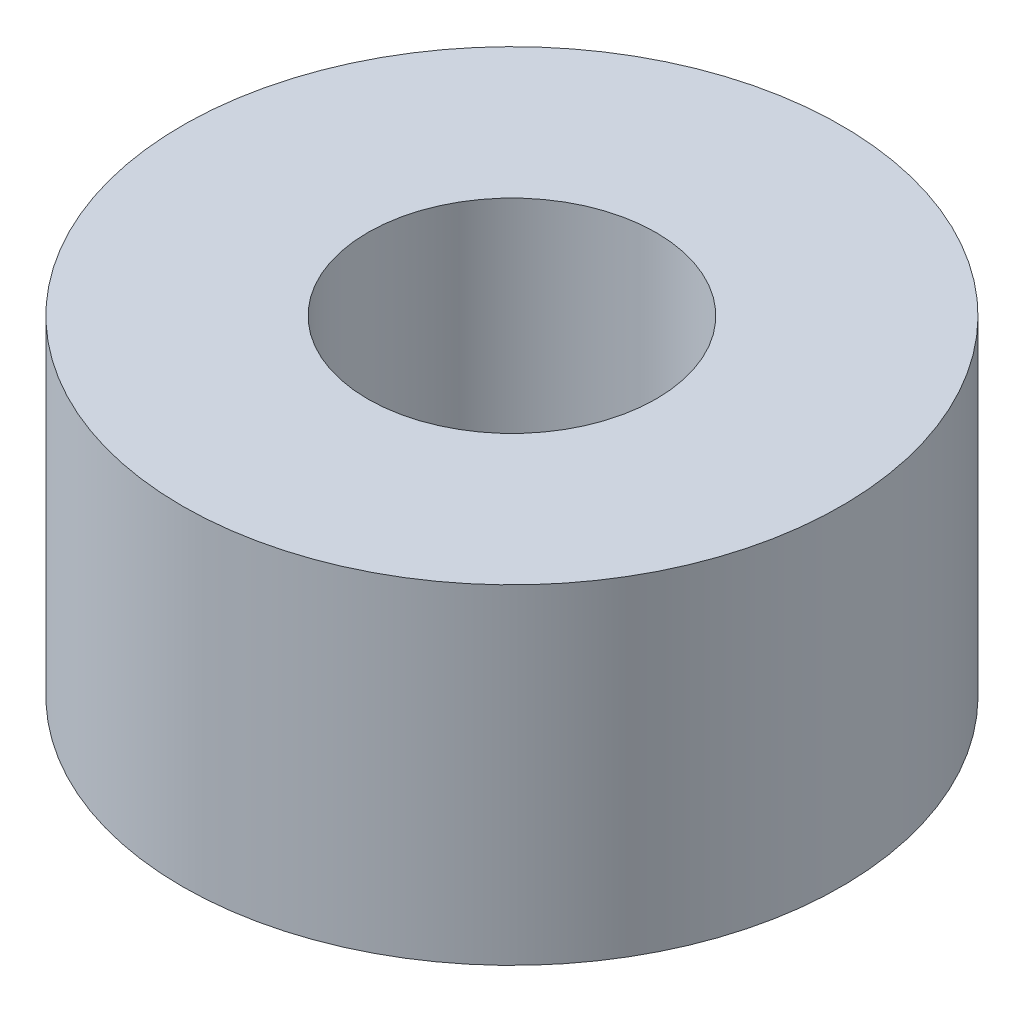
ISO-10303-21;
HEADER;
FILE_DESCRIPTION(('STEP AP214'),'2;1');
FILE_NAME('part.step','',(''),(''),'','','');
FILE_SCHEMA(('AUTOMOTIVE_DESIGN { 1 0 10303 214 1 1 1 1 }'));
ENDSEC;
DATA;
#1=APPLICATION_CONTEXT('core data for automotive mechanical design processes');
#2=APPLICATION_PROTOCOL_DEFINITION('international standard','automotive_design',2000,#1);
#3=PRODUCT_CONTEXT('',#1,'mechanical');
#4=PRODUCT('Part','Part','',(#3));
#5=PRODUCT_RELATED_PRODUCT_CATEGORY('part','',(#4));
#6=PRODUCT_DEFINITION_FORMATION('','',#4);
#7=PRODUCT_DEFINITION_CONTEXT('part definition',#1,'design');
#8=PRODUCT_DEFINITION('design','',#6,#7);
#9=PRODUCT_DEFINITION_SHAPE('','',#8);
#10=(LENGTH_UNIT() NAMED_UNIT(*) SI_UNIT(.MILLI.,.METRE.));
#11=(NAMED_UNIT(*) PLANE_ANGLE_UNIT() SI_UNIT($,.RADIAN.));
#12=(NAMED_UNIT(*) SI_UNIT($,.STERADIAN.) SOLID_ANGLE_UNIT());
#13=UNCERTAINTY_MEASURE_WITH_UNIT(LENGTH_MEASURE(1.E-05),#10,'distance_accuracy_value','');
#14=(GEOMETRIC_REPRESENTATION_CONTEXT(3) GLOBAL_UNCERTAINTY_ASSIGNED_CONTEXT((#13)) GLOBAL_UNIT_ASSIGNED_CONTEXT((#10,
#11,#12)) REPRESENTATION_CONTEXT('',''));
#15=CARTESIAN_POINT('',(0.,0.,0.));
#16=DIRECTION('',(0.,0.,1.));
#17=DIRECTION('',(1.,0.,0.));
#18=AXIS2_PLACEMENT_3D('',#15,#16,#17);
#19=CARTESIAN_POINT('',(0.,4.,0.));
#20=DIRECTION('',(0.,1.,0.));
#21=DIRECTION('',(0.,0.,1.));
#22=AXIS2_PLACEMENT_3D('',#19,#20,#21);
#23=PLANE('',#22);
#24=CARTESIAN_POINT('',(0.,4.,0.));
#25=DIRECTION('',(0.,1.,0.));
#26=DIRECTION('',(0.,0.,1.));
#27=AXIS2_PLACEMENT_3D('',#24,#25,#26);
#28=CIRCLE('',#27,4.);
#29=CARTESIAN_POINT('',(0.,4.,4.));
#30=VERTEX_POINT('',#29);
#31=EDGE_CURVE('E10',#30,#30,#28,.T.);
#32=ORIENTED_EDGE('',*,*,#31,.T.);
#33=EDGE_LOOP('',(#32));
#34=FACE_BOUND('',#33,.T.);
#35=CARTESIAN_POINT('',(0.,4.,0.));
#36=DIRECTION('',(0.,1.,0.));
#37=DIRECTION('',(0.,0.,1.));
#38=AXIS2_PLACEMENT_3D('',#35,#36,#37);
#39=CIRCLE('',#38,1.75);
#40=CARTESIAN_POINT('',(0.,4.,1.75));
#41=VERTEX_POINT('',#40);
#42=EDGE_CURVE('E44',#41,#41,#39,.T.);
#43=ORIENTED_EDGE('',*,*,#42,.F.);
#44=EDGE_LOOP('',(#43));
#45=FACE_BOUND('',#44,.T.);
#46=ADVANCED_FACE('F33',(#34,#45),#23,.T.);
#47=CARTESIAN_POINT('',(0.,0.,0.));
#48=DIRECTION('',(0.,1.,0.));
#49=DIRECTION('',(0.,0.,1.));
#50=AXIS2_PLACEMENT_3D('',#47,#48,#49);
#51=PLANE('',#50);
#52=CARTESIAN_POINT('',(0.,0.,0.));
#53=DIRECTION('',(0.,1.,0.));
#54=DIRECTION('',(0.,0.,1.));
#55=AXIS2_PLACEMENT_3D('',#52,#53,#54);
#56=CIRCLE('',#55,4.);
#57=CARTESIAN_POINT('',(0.,0.,4.));
#58=VERTEX_POINT('',#57);
#59=EDGE_CURVE('E37',#58,#58,#56,.T.);
#60=ORIENTED_EDGE('',*,*,#59,.F.);
#61=EDGE_LOOP('',(#60));
#62=FACE_BOUND('',#61,.T.);
#63=CARTESIAN_POINT('',(0.,0.,0.));
#64=DIRECTION('',(0.,1.,0.));
#65=DIRECTION('',(0.,0.,1.));
#66=AXIS2_PLACEMENT_3D('',#63,#64,#65);
#67=CIRCLE('',#66,1.75);
#68=CARTESIAN_POINT('',(0.,0.,1.75));
#69=VERTEX_POINT('',#68);
#70=EDGE_CURVE('E46',#69,#69,#67,.T.);
#71=ORIENTED_EDGE('',*,*,#70,.T.);
#72=EDGE_LOOP('',(#71));
#73=FACE_BOUND('',#72,.T.);
#74=ADVANCED_FACE('F56',(#62,#73),#51,.F.);
#75=CARTESIAN_POINT('',(0.,4.,0.));
#76=DIRECTION('',(0.,-1.,0.));
#77=DIRECTION('',(0.,0.,-1.));
#78=AXIS2_PLACEMENT_3D('',#75,#76,#77);
#79=CYLINDRICAL_SURFACE('',#78,4.);
#80=ORIENTED_EDGE('',*,*,#31,.F.);
#81=EDGE_LOOP('',(#80));
#82=FACE_BOUND('',#81,.T.);
#83=ORIENTED_EDGE('',*,*,#59,.T.);
#84=EDGE_LOOP('',(#83));
#85=FACE_BOUND('',#84,.T.);
#86=ADVANCED_FACE('F35',(#82,#85),#79,.T.);
#87=CARTESIAN_POINT('',(0.,4.,0.));
#88=DIRECTION('',(0.,-1.,0.));
#89=DIRECTION('',(0.,0.,-1.));
#90=AXIS2_PLACEMENT_3D('',#87,#88,#89);
#91=CYLINDRICAL_SURFACE('',#90,1.75);
#92=ORIENTED_EDGE('',*,*,#42,.T.);
#93=EDGE_LOOP('',(#92));
#94=FACE_BOUND('',#93,.T.);
#95=ORIENTED_EDGE('',*,*,#70,.F.);
#96=EDGE_LOOP('',(#95));
#97=FACE_BOUND('',#96,.T.);
#98=ADVANCED_FACE('F52',(#94,#97),#91,.F.);
#99=CLOSED_SHELL('',(#46,#74,#86,#98));
#100=MANIFOLD_SOLID_BREP('B2',#99);
#101=ADVANCED_BREP_SHAPE_REPRESENTATION('',(#18,#100),#14);
#102=SHAPE_DEFINITION_REPRESENTATION(#9,#101);
ENDSEC;
END-ISO-10303-21;
